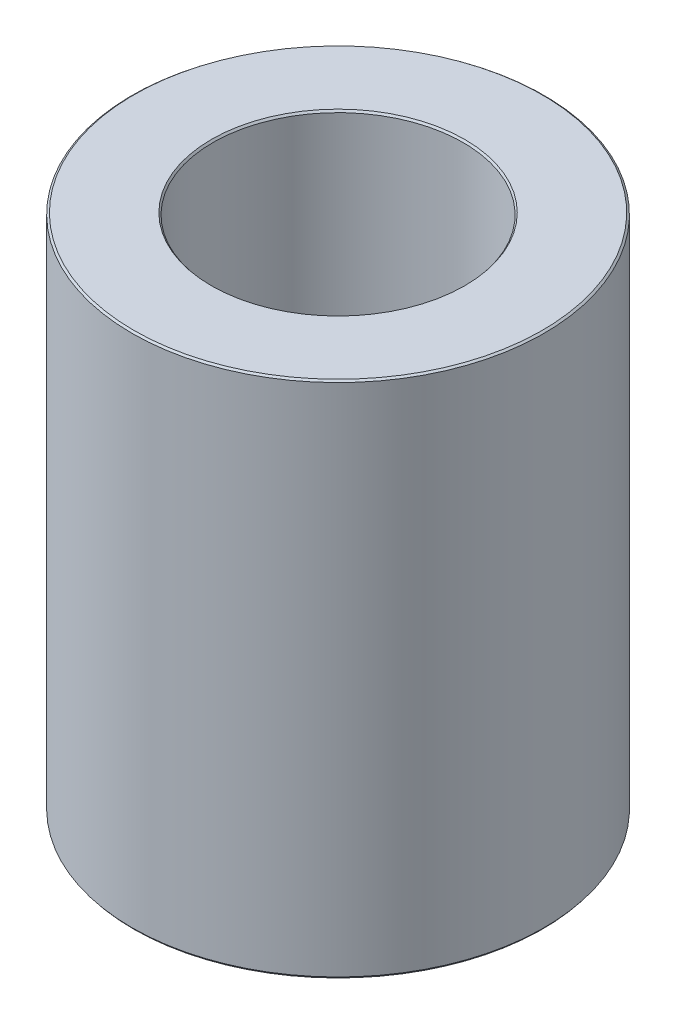
ISO-10303-21;
HEADER;
FILE_DESCRIPTION(('STEP AP214'),'2;1');
FILE_NAME('part.step','',(''),(''),'','','');
FILE_SCHEMA(('AUTOMOTIVE_DESIGN { 1 0 10303 214 1 1 1 1 }'));
ENDSEC;
DATA;
#1=APPLICATION_CONTEXT('core data for automotive mechanical design processes');
#2=APPLICATION_PROTOCOL_DEFINITION('international standard','automotive_design',2000,#1);
#3=PRODUCT_CONTEXT('',#1,'mechanical');
#4=PRODUCT('Part','Part','',(#3));
#5=PRODUCT_RELATED_PRODUCT_CATEGORY('part','',(#4));
#6=PRODUCT_DEFINITION_FORMATION('','',#4);
#7=PRODUCT_DEFINITION_CONTEXT('part definition',#1,'design');
#8=PRODUCT_DEFINITION('design','',#6,#7);
#9=PRODUCT_DEFINITION_SHAPE('','',#8);
#10=(LENGTH_UNIT() NAMED_UNIT(*) SI_UNIT(.MILLI.,.METRE.));
#11=(NAMED_UNIT(*) PLANE_ANGLE_UNIT() SI_UNIT($,.RADIAN.));
#12=(NAMED_UNIT(*) SI_UNIT($,.STERADIAN.) SOLID_ANGLE_UNIT());
#13=UNCERTAINTY_MEASURE_WITH_UNIT(LENGTH_MEASURE(1.E-05),#10,'distance_accuracy_value','');
#14=(GEOMETRIC_REPRESENTATION_CONTEXT(3) GLOBAL_UNCERTAINTY_ASSIGNED_CONTEXT((#13)) GLOBAL_UNIT_ASSIGNED_CONTEXT((#10,
#11,#12)) REPRESENTATION_CONTEXT('',''));
#15=CARTESIAN_POINT('',(0.,0.,0.));
#16=DIRECTION('',(0.,0.,1.));
#17=DIRECTION('',(1.,0.,0.));
#18=AXIS2_PLACEMENT_3D('',#15,#16,#17);
#19=CARTESIAN_POINT('',(0.,125.744711870927,0.));
#20=DIRECTION('',(0.,-1.,0.));
#21=DIRECTION('',(0.,0.,-1.));
#22=AXIS2_PLACEMENT_3D('',#19,#20,#21);
#23=CYLINDRICAL_SURFACE('',#22,50.);
#24=CARTESIAN_POINT('',(0.,0.472070309576744,0.));
#25=DIRECTION('',(0.,1.,0.));
#26=DIRECTION('',(0.,0.,1.));
#27=AXIS2_PLACEMENT_3D('',#24,#25,#26);
#28=CIRCLE('',#27,50.);
#29=CARTESIAN_POINT('',(0.,0.472070309576744,50.));
#30=VERTEX_POINT('',#29);
#31=EDGE_CURVE('E10',#30,#30,#28,.T.);
#32=ORIENTED_EDGE('',*,*,#31,.T.);
#33=EDGE_LOOP('',(#32));
#34=FACE_BOUND('',#33,.T.);
#35=CARTESIAN_POINT('',(0.,125.377431337922,0.));
#36=DIRECTION('',(0.,1.,0.));
#37=DIRECTION('',(0.,0.,1.));
#38=AXIS2_PLACEMENT_3D('',#35,#36,#37);
#39=CIRCLE('',#38,50.);
#40=CARTESIAN_POINT('',(0.,125.377431337922,50.));
#41=VERTEX_POINT('',#40);
#42=EDGE_CURVE('E50',#41,#41,#39,.F.);
#43=ORIENTED_EDGE('',*,*,#42,.T.);
#44=EDGE_LOOP('',(#43));
#45=FACE_BOUND('',#44,.T.);
#46=ADVANCED_FACE('F39',(#34,#45),#23,.T.);
#47=CARTESIAN_POINT('',(0.,125.744711870927,0.));
#48=DIRECTION('',(0.,1.,0.));
#49=DIRECTION('',(0.,0.,1.));
#50=AXIS2_PLACEMENT_3D('',#47,#48,#49);
#51=PLANE('',#50);
#52=CARTESIAN_POINT('',(0.,125.744711870927,0.));
#53=DIRECTION('',(0.,1.,0.));
#54=DIRECTION('',(0.,0.,1.));
#55=AXIS2_PLACEMENT_3D('',#52,#53,#54);
#56=CIRCLE('',#55,30.7482822839049);
#57=CARTESIAN_POINT('',(0.,125.744711870927,30.7482822839049));
#58=VERTEX_POINT('',#57);
#59=EDGE_CURVE('E58',#58,#58,#56,.F.);
#60=ORIENTED_EDGE('',*,*,#59,.T.);
#61=EDGE_LOOP('',(#60));
#62=FACE_BOUND('',#61,.T.);
#63=CARTESIAN_POINT('',(0.,125.744711870927,0.));
#64=DIRECTION('',(0.,1.,0.));
#65=DIRECTION('',(0.,0.,1.));
#66=AXIS2_PLACEMENT_3D('',#63,#64,#65);
#67=CIRCLE('',#66,49.5279296904232);
#68=CARTESIAN_POINT('',(0.,125.744711870927,49.5279296904232));
#69=VERTEX_POINT('',#68);
#70=EDGE_CURVE('E61',#69,#69,#67,.T.);
#71=ORIENTED_EDGE('',*,*,#70,.T.);
#72=EDGE_LOOP('',(#71));
#73=FACE_BOUND('',#72,.T.);
#74=ADVANCED_FACE('F88',(#62,#73),#51,.T.);
#75=CARTESIAN_POINT('',(0.,0.,0.));
#76=DIRECTION('',(0.,1.,0.));
#77=DIRECTION('',(0.,0.,1.));
#78=AXIS2_PLACEMENT_3D('',#75,#76,#77);
#79=PLANE('',#78);
#80=CARTESIAN_POINT('',(0.,0.,0.));
#81=DIRECTION('',(0.,1.,0.));
#82=DIRECTION('',(0.,0.,1.));
#83=AXIS2_PLACEMENT_3D('',#80,#81,#82);
#84=CIRCLE('',#83,30.8530720604767);
#85=CARTESIAN_POINT('',(0.,0.,30.8530720604767));
#86=VERTEX_POINT('',#85);
#87=EDGE_CURVE('E51',#86,#86,#84,.T.);
#88=ORIENTED_EDGE('',*,*,#87,.T.);
#89=EDGE_LOOP('',(#88));
#90=FACE_BOUND('',#89,.T.);
#91=CARTESIAN_POINT('',(0.,0.,0.));
#92=DIRECTION('',(0.,1.,0.));
#93=DIRECTION('',(0.,0.,1.));
#94=AXIS2_PLACEMENT_3D('',#91,#92,#93);
#95=CIRCLE('',#94,49.6327194669951);
#96=CARTESIAN_POINT('',(0.,0.,49.6327194669951));
#97=VERTEX_POINT('',#96);
#98=EDGE_CURVE('E54',#97,#97,#95,.F.);
#99=ORIENTED_EDGE('',*,*,#98,.T.);
#100=EDGE_LOOP('',(#99));
#101=FACE_BOUND('',#100,.T.);
#102=ADVANCED_FACE('F83',(#90,#101),#79,.F.);
#103=CARTESIAN_POINT('',(0.,125.744711870927,0.));
#104=DIRECTION('',(0.,-1.,0.));
#105=DIRECTION('',(0.,0.,-1.));
#106=AXIS2_PLACEMENT_3D('',#103,#104,#105);
#107=CYLINDRICAL_SURFACE('',#106,30.3810017509);
#108=CARTESIAN_POINT('',(0.,125.27264156135,0.));
#109=DIRECTION('',(0.,1.,0.));
#110=DIRECTION('',(0.,0.,1.));
#111=AXIS2_PLACEMENT_3D('',#108,#109,#110);
#112=CIRCLE('',#111,30.3810017509);
#113=CARTESIAN_POINT('',(0.,125.27264156135,30.3810017509));
#114=VERTEX_POINT('',#113);
#115=EDGE_CURVE('E67',#114,#114,#112,.T.);
#116=ORIENTED_EDGE('',*,*,#115,.T.);
#117=EDGE_LOOP('',(#116));
#118=FACE_BOUND('',#117,.T.);
#119=CARTESIAN_POINT('',(0.,0.367280533004943,0.));
#120=DIRECTION('',(0.,1.,0.));
#121=DIRECTION('',(0.,0.,1.));
#122=AXIS2_PLACEMENT_3D('',#119,#120,#121);
#123=CIRCLE('',#122,30.3810017509);
#124=CARTESIAN_POINT('',(0.,0.367280533004943,30.3810017509));
#125=VERTEX_POINT('',#124);
#126=EDGE_CURVE('E69',#125,#125,#123,.F.);
#127=ORIENTED_EDGE('',*,*,#126,.T.);
#128=EDGE_LOOP('',(#127));
#129=FACE_BOUND('',#128,.T.);
#130=ADVANCED_FACE('F71',(#118,#129),#107,.F.);
#131=CARTESIAN_POINT('',(0.,125.27264156135,0.));
#132=DIRECTION('',(0.,1.,0.));
#133=DIRECTION('',(0.,0.,1.));
#134=AXIS2_PLACEMENT_3D('',#131,#132,#133);
#135=CONICAL_SURFACE('',#134,30.3810017509,0.661194589832326);
#136=ORIENTED_EDGE('',*,*,#59,.F.);
#137=EDGE_LOOP('',(#136));
#138=FACE_BOUND('',#137,.T.);
#139=ORIENTED_EDGE('',*,*,#115,.F.);
#140=EDGE_LOOP('',(#139));
#141=FACE_BOUND('',#140,.T.);
#142=ADVANCED_FACE('F77',(#138,#141),#135,.F.);
#143=CARTESIAN_POINT('',(0.,0.,0.));
#144=DIRECTION('',(0.,-1.,0.));
#145=DIRECTION('',(0.,0.,-1.));
#146=AXIS2_PLACEMENT_3D('',#143,#144,#145);
#147=CONICAL_SURFACE('',#146,30.8530720604767,0.909601736962542);
#148=ORIENTED_EDGE('',*,*,#126,.F.);
#149=EDGE_LOOP('',(#148));
#150=FACE_BOUND('',#149,.T.);
#151=ORIENTED_EDGE('',*,*,#87,.F.);
#152=EDGE_LOOP('',(#151));
#153=FACE_BOUND('',#152,.T.);
#154=ADVANCED_FACE('F73',(#150,#153),#147,.F.);
#155=CARTESIAN_POINT('',(0.,0.472070309576744,0.));
#156=DIRECTION('',(0.,1.,0.));
#157=DIRECTION('',(0.,0.,1.));
#158=AXIS2_PLACEMENT_3D('',#155,#156,#157);
#159=CONICAL_SURFACE('',#158,50.,0.661194589832371);
#160=ORIENTED_EDGE('',*,*,#98,.F.);
#161=EDGE_LOOP('',(#160));
#162=FACE_BOUND('',#161,.T.);
#163=ORIENTED_EDGE('',*,*,#31,.F.);
#164=EDGE_LOOP('',(#163));
#165=FACE_BOUND('',#164,.T.);
#166=ADVANCED_FACE('F76',(#162,#165),#159,.T.);
#167=CARTESIAN_POINT('',(0.,125.744711870927,0.));
#168=DIRECTION('',(0.,-1.,0.));
#169=DIRECTION('',(0.,0.,-1.));
#170=AXIS2_PLACEMENT_3D('',#167,#168,#169);
#171=CONICAL_SURFACE('',#170,49.5279296904232,0.909601736962524);
#172=ORIENTED_EDGE('',*,*,#42,.F.);
#173=EDGE_LOOP('',(#172));
#174=FACE_BOUND('',#173,.T.);
#175=ORIENTED_EDGE('',*,*,#70,.F.);
#176=EDGE_LOOP('',(#175));
#177=FACE_BOUND('',#176,.T.);
#178=ADVANCED_FACE('F45',(#174,#177),#171,.T.);
#179=CLOSED_SHELL('',(#46,#74,#102,#130,#142,#154,#166,#178));
#180=MANIFOLD_SOLID_BREP('B2',#179);
#181=ADVANCED_BREP_SHAPE_REPRESENTATION('',(#18,#180),#14);
#182=SHAPE_DEFINITION_REPRESENTATION(#9,#181);
ENDSEC;
END-ISO-10303-21;
